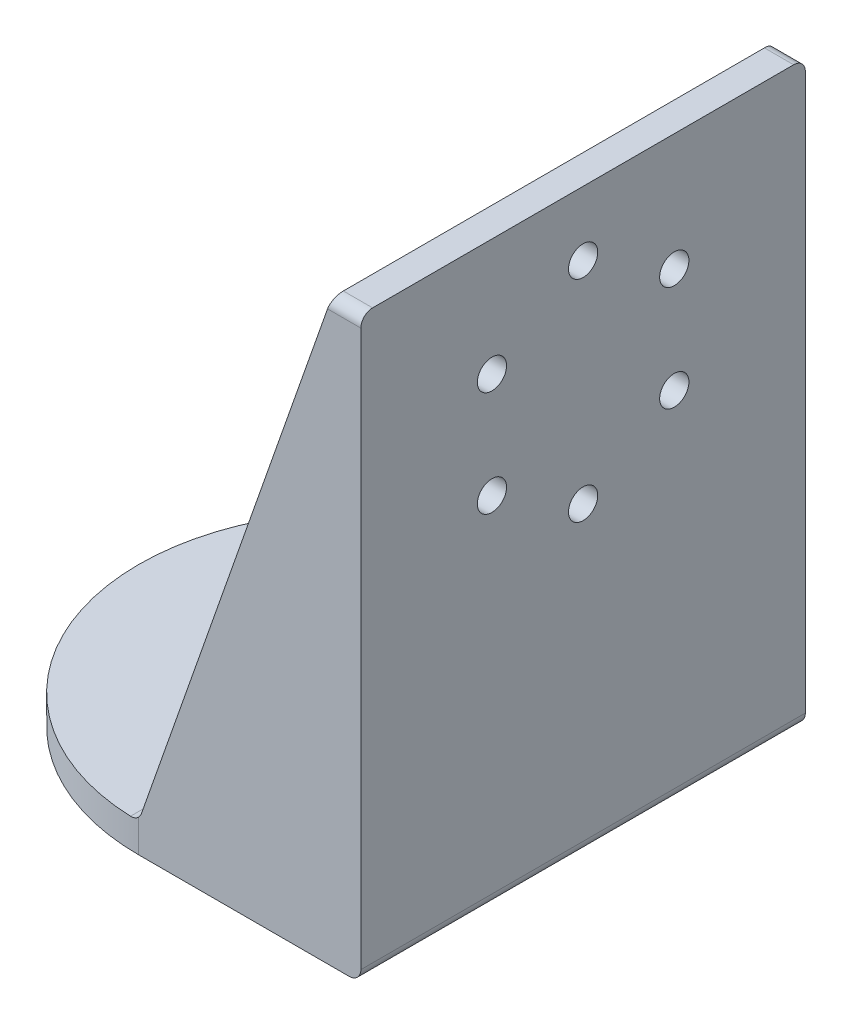
ISO-10303-21;
HEADER;
FILE_DESCRIPTION(('STEP AP214'),'2;1');
FILE_NAME('part.step','',(''),(''),'','','');
FILE_SCHEMA(('AUTOMOTIVE_DESIGN { 1 0 10303 214 1 1 1 1 }'));
ENDSEC;
DATA;
#1=APPLICATION_CONTEXT('core data for automotive mechanical design processes');
#2=APPLICATION_PROTOCOL_DEFINITION('international standard','automotive_design',2000,#1);
#3=PRODUCT_CONTEXT('',#1,'mechanical');
#4=PRODUCT('Part','Part','',(#3));
#5=PRODUCT_RELATED_PRODUCT_CATEGORY('part','',(#4));
#6=PRODUCT_DEFINITION_FORMATION('','',#4);
#7=PRODUCT_DEFINITION_CONTEXT('part definition',#1,'design');
#8=PRODUCT_DEFINITION('design','',#6,#7);
#9=PRODUCT_DEFINITION_SHAPE('','',#8);
#10=(LENGTH_UNIT() NAMED_UNIT(*) SI_UNIT(.MILLI.,.METRE.));
#11=(NAMED_UNIT(*) PLANE_ANGLE_UNIT() SI_UNIT($,.RADIAN.));
#12=(NAMED_UNIT(*) SI_UNIT($,.STERADIAN.) SOLID_ANGLE_UNIT());
#13=UNCERTAINTY_MEASURE_WITH_UNIT(LENGTH_MEASURE(1.E-05),#10,'distance_accuracy_value','');
#14=(GEOMETRIC_REPRESENTATION_CONTEXT(3) GLOBAL_UNCERTAINTY_ASSIGNED_CONTEXT((#13)) GLOBAL_UNIT_ASSIGNED_CONTEXT((#10,
#11,#12)) REPRESENTATION_CONTEXT('',''));
#15=CARTESIAN_POINT('',(0.,0.,0.));
#16=DIRECTION('',(0.,0.,1.));
#17=DIRECTION('',(1.,0.,0.));
#18=AXIS2_PLACEMENT_3D('',#15,#16,#17);
#19=CARTESIAN_POINT('',(71.,5.00000000000001,76.));
#20=DIRECTION('',(1.,0.,0.));
#21=DIRECTION('',(0.,0.,-1.));
#22=AXIS2_PLACEMENT_3D('',#19,#20,#21);
#23=PLANE('',#22);
#24=CARTESIAN_POINT('',(71.,61.,53.5884572681199));
#25=DIRECTION('',(1.,0.,0.));
#26=DIRECTION('',(0.,0.,-1.));
#27=AXIS2_PLACEMENT_3D('',#24,#25,#26);
#28=CIRCLE('',#27,2.5);
#29=CARTESIAN_POINT('',(71.,61.,51.0884572681199));
#30=VERTEX_POINT('',#29);
#31=EDGE_CURVE('E488',#30,#30,#28,.T.);
#32=ORIENTED_EDGE('',*,*,#31,.T.);
#33=EDGE_LOOP('',(#32));
#34=FACE_BOUND('',#33,.T.);
#35=CARTESIAN_POINT('',(71.,52.,38.));
#36=DIRECTION('',(1.,0.,0.));
#37=DIRECTION('',(0.,0.,-1.));
#38=AXIS2_PLACEMENT_3D('',#35,#36,#37);
#39=CIRCLE('',#38,2.5);
#40=CARTESIAN_POINT('',(71.,52.,35.5));
#41=VERTEX_POINT('',#40);
#42=EDGE_CURVE('E485',#41,#41,#39,.T.);
#43=ORIENTED_EDGE('',*,*,#42,.T.);
#44=EDGE_LOOP('',(#43));
#45=FACE_BOUND('',#44,.T.);
#46=CARTESIAN_POINT('',(71.,61.,22.4115427318801));
#47=DIRECTION('',(1.,0.,0.));
#48=DIRECTION('',(0.,0.,-1.));
#49=AXIS2_PLACEMENT_3D('',#46,#47,#48);
#50=CIRCLE('',#49,2.5);
#51=CARTESIAN_POINT('',(71.,61.,19.9115427318801));
#52=VERTEX_POINT('',#51);
#53=EDGE_CURVE('E477',#52,#52,#50,.T.);
#54=ORIENTED_EDGE('',*,*,#53,.T.);
#55=EDGE_LOOP('',(#54));
#56=FACE_BOUND('',#55,.T.);
#57=CARTESIAN_POINT('',(71.,79.,22.4115427318801));
#58=DIRECTION('',(1.,0.,0.));
#59=DIRECTION('',(0.,0.,-1.));
#60=AXIS2_PLACEMENT_3D('',#57,#58,#59);
#61=CIRCLE('',#60,2.5);
#62=CARTESIAN_POINT('',(71.,79.,19.9115427318801));
#63=VERTEX_POINT('',#62);
#64=EDGE_CURVE('E473',#63,#63,#61,.T.);
#65=ORIENTED_EDGE('',*,*,#64,.T.);
#66=EDGE_LOOP('',(#65));
#67=FACE_BOUND('',#66,.T.);
#68=CARTESIAN_POINT('',(71.,88.,38.));
#69=DIRECTION('',(1.,0.,0.));
#70=DIRECTION('',(0.,0.,-1.));
#71=AXIS2_PLACEMENT_3D('',#68,#69,#70);
#72=CIRCLE('',#71,2.5);
#73=CARTESIAN_POINT('',(71.,88.,35.5));
#74=VERTEX_POINT('',#73);
#75=EDGE_CURVE('E471',#74,#74,#72,.T.);
#76=ORIENTED_EDGE('',*,*,#75,.T.);
#77=EDGE_LOOP('',(#76));
#78=FACE_BOUND('',#77,.T.);
#79=CARTESIAN_POINT('',(71.,79.,53.5884572681199));
#80=DIRECTION('',(1.,0.,0.));
#81=DIRECTION('',(0.,0.,-1.));
#82=AXIS2_PLACEMENT_3D('',#79,#80,#81);
#83=CIRCLE('',#82,2.5);
#84=CARTESIAN_POINT('',(71.,79.,51.0884572681199));
#85=VERTEX_POINT('',#84);
#86=EDGE_CURVE('E474',#85,#85,#83,.T.);
#87=ORIENTED_EDGE('',*,*,#86,.T.);
#88=EDGE_LOOP('',(#87));
#89=FACE_BOUND('',#88,.T.);
#90=DIRECTION('',(0.,1.,0.));
#91=VECTOR('',#90,1.);
#92=CARTESIAN_POINT('',(71.,5.00000000000001,5.));
#93=LINE('',#92,#91);
#94=CARTESIAN_POINT('',(71.,15.,5.));
#95=VERTEX_POINT('',#94);
#96=CARTESIAN_POINT('',(71.,99.,5.));
#97=VERTEX_POINT('',#96);
#98=EDGE_CURVE('E173',#95,#97,#93,.T.);
#99=ORIENTED_EDGE('',*,*,#98,.F.);
#100=DIRECTION('',(0.,0.,1.));
#101=VECTOR('',#100,1.);
#102=CARTESIAN_POINT('',(71.,15.,71.));
#103=LINE('',#102,#101);
#104=CARTESIAN_POINT('',(71.,15.,71.));
#105=VERTEX_POINT('',#104);
#106=EDGE_CURVE('E180',#95,#105,#103,.T.);
#107=ORIENTED_EDGE('',*,*,#106,.T.);
#108=DIRECTION('',(0.,-1.,0.));
#109=VECTOR('',#108,1.);
#110=CARTESIAN_POINT('',(71.,5.00000000000001,71.));
#111=LINE('',#110,#109);
#112=CARTESIAN_POINT('',(71.,99.,71.));
#113=VERTEX_POINT('',#112);
#114=EDGE_CURVE('E168',#113,#105,#111,.T.);
#115=ORIENTED_EDGE('',*,*,#114,.F.);
#116=DIRECTION('',(0.,0.,-1.));
#117=VECTOR('',#116,1.);
#118=CARTESIAN_POINT('',(71.,99.,76.));
#119=LINE('',#118,#117);
#120=EDGE_CURVE('E162',#113,#97,#119,.T.);
#121=ORIENTED_EDGE('',*,*,#120,.T.);
#122=EDGE_LOOP('',(#99,#107,#115,#121));
#123=FACE_BOUND('',#122,.T.);
#124=ADVANCED_FACE('F38',(#34,#45,#56,#67,#78,#89,#123),#23,.F.);
#125=CARTESIAN_POINT('',(76.,0.,76.));
#126=DIRECTION('',(0.,1.,0.));
#127=DIRECTION('',(-1.,0.,0.));
#128=AXIS2_PLACEMENT_3D('',#125,#126,#127);
#129=PLANE('',#128);
#130=CARTESIAN_POINT('',(20.,0.,38.));
#131=DIRECTION('',(0.,1.,0.));
#132=DIRECTION('',(-1.,0.,0.));
#133=AXIS2_PLACEMENT_3D('',#130,#131,#132);
#134=CIRCLE('',#133,2.5);
#135=CARTESIAN_POINT('',(17.5,0.,38.));
#136=VERTEX_POINT('',#135);
#137=EDGE_CURVE('E379',#136,#136,#134,.T.);
#138=ORIENTED_EDGE('',*,*,#137,.T.);
#139=EDGE_LOOP('',(#138));
#140=FACE_BOUND('',#139,.T.);
#141=CARTESIAN_POINT('',(28.9999999999998,0.,53.5884572681198));
#142=DIRECTION('',(0.,1.,0.));
#143=DIRECTION('',(-1.,0.,0.));
#144=AXIS2_PLACEMENT_3D('',#141,#142,#143);
#145=CIRCLE('',#144,2.5);
#146=CARTESIAN_POINT('',(26.4999999999998,0.,53.5884572681198));
#147=VERTEX_POINT('',#146);
#148=EDGE_CURVE('E383',#147,#147,#145,.T.);
#149=ORIENTED_EDGE('',*,*,#148,.T.);
#150=EDGE_LOOP('',(#149));
#151=FACE_BOUND('',#150,.T.);
#152=CARTESIAN_POINT('',(46.9999999999999,0.,53.58845726812));
#153=DIRECTION('',(0.,1.,0.));
#154=DIRECTION('',(-1.,0.,0.));
#155=AXIS2_PLACEMENT_3D('',#152,#153,#154);
#156=CIRCLE('',#155,2.5);
#157=CARTESIAN_POINT('',(44.4999999999999,0.,53.58845726812));
#158=VERTEX_POINT('',#157);
#159=EDGE_CURVE('E517',#158,#158,#156,.T.);
#160=ORIENTED_EDGE('',*,*,#159,.T.);
#161=EDGE_LOOP('',(#160));
#162=FACE_BOUND('',#161,.T.);
#163=CARTESIAN_POINT('',(56.,0.,38.0000000000001));
#164=DIRECTION('',(0.,1.,0.));
#165=DIRECTION('',(-1.,0.,0.));
#166=AXIS2_PLACEMENT_3D('',#163,#164,#165);
#167=CIRCLE('',#166,2.5);
#168=CARTESIAN_POINT('',(53.5,0.,38.0000000000001));
#169=VERTEX_POINT('',#168);
#170=EDGE_CURVE('E514',#169,#169,#167,.T.);
#171=ORIENTED_EDGE('',*,*,#170,.T.);
#172=EDGE_LOOP('',(#171));
#173=FACE_BOUND('',#172,.T.);
#174=CARTESIAN_POINT('',(47.0000000000001,0.,22.4115427318801));
#175=DIRECTION('',(0.,1.,0.));
#176=DIRECTION('',(-1.,0.,0.));
#177=AXIS2_PLACEMENT_3D('',#174,#175,#176);
#178=CIRCLE('',#177,2.5);
#179=CARTESIAN_POINT('',(44.5000000000001,0.,22.4115427318801));
#180=VERTEX_POINT('',#179);
#181=EDGE_CURVE('E511',#180,#180,#178,.T.);
#182=ORIENTED_EDGE('',*,*,#181,.T.);
#183=EDGE_LOOP('',(#182));
#184=FACE_BOUND('',#183,.T.);
#185=CARTESIAN_POINT('',(29.,0.,22.4115427318801));
#186=DIRECTION('',(0.,1.,0.));
#187=DIRECTION('',(-1.,0.,0.));
#188=AXIS2_PLACEMENT_3D('',#185,#186,#187);
#189=CIRCLE('',#188,2.5);
#190=CARTESIAN_POINT('',(26.5,0.,22.4115427318801));
#191=VERTEX_POINT('',#190);
#192=EDGE_CURVE('E494',#191,#191,#189,.T.);
#193=ORIENTED_EDGE('',*,*,#192,.T.);
#194=EDGE_LOOP('',(#193));
#195=FACE_BOUND('',#194,.T.);
#196=DIRECTION('',(1.,0.,0.));
#197=VECTOR('',#196,1.);
#198=CARTESIAN_POINT('',(76.,0.,0.));
#199=LINE('',#198,#197);
#200=CARTESIAN_POINT('',(38.,0.,0.));
#201=VERTEX_POINT('',#200);
#202=CARTESIAN_POINT('',(74.,0.,0.));
#203=VERTEX_POINT('',#202);
#204=EDGE_CURVE('E213',#201,#203,#199,.T.);
#205=ORIENTED_EDGE('',*,*,#204,.T.);
#206=DIRECTION('',(0.,0.,-1.));
#207=VECTOR('',#206,1.);
#208=CARTESIAN_POINT('',(74.,0.,76.));
#209=LINE('',#208,#207);
#210=CARTESIAN_POINT('',(74.,0.,76.));
#211=VERTEX_POINT('',#210);
#212=EDGE_CURVE('E223',#203,#211,#209,.F.);
#213=ORIENTED_EDGE('',*,*,#212,.T.);
#214=DIRECTION('',(1.,0.,0.));
#215=VECTOR('',#214,1.);
#216=CARTESIAN_POINT('',(76.,0.,76.));
#217=LINE('',#216,#215);
#218=CARTESIAN_POINT('',(38.,0.,76.));
#219=VERTEX_POINT('',#218);
#220=EDGE_CURVE('E190',#219,#211,#217,.T.);
#221=ORIENTED_EDGE('',*,*,#220,.F.);
#222=CARTESIAN_POINT('',(38.,0.,38.));
#223=DIRECTION('',(0.,1.,0.));
#224=DIRECTION('',(-1.,0.,0.));
#225=AXIS2_PLACEMENT_3D('',#222,#223,#224);
#226=CIRCLE('',#225,38.);
#227=CARTESIAN_POINT('',(0.,0.,38.));
#228=VERTEX_POINT('',#227);
#229=EDGE_CURVE('E197',#219,#228,#226,.F.);
#230=ORIENTED_EDGE('',*,*,#229,.T.);
#231=CARTESIAN_POINT('',(38.,0.,38.));
#232=DIRECTION('',(0.,1.,0.));
#233=DIRECTION('',(-1.,0.,0.));
#234=AXIS2_PLACEMENT_3D('',#231,#232,#233);
#235=CIRCLE('',#234,38.);
#236=EDGE_CURVE('E199',#228,#201,#235,.F.);
#237=ORIENTED_EDGE('',*,*,#236,.T.);
#238=EDGE_LOOP('',(#205,#213,#221,#230,#237));
#239=FACE_BOUND('',#238,.T.);
#240=ADVANCED_FACE('F293',(#140,#151,#162,#173,#184,#195,#239),#129,.F.);
#241=CARTESIAN_POINT('',(76.,0.,76.));
#242=DIRECTION('',(-1.,0.,0.));
#243=DIRECTION('',(0.,0.,1.));
#244=AXIS2_PLACEMENT_3D('',#241,#242,#243);
#245=PLANE('',#244);
#246=CARTESIAN_POINT('',(76.,61.,53.5884572681199));
#247=DIRECTION('',(1.,0.,0.));
#248=DIRECTION('',(0.,0.,-1.));
#249=AXIS2_PLACEMENT_3D('',#246,#247,#248);
#250=CIRCLE('',#249,2.5);
#251=CARTESIAN_POINT('',(76.,61.,51.0884572681199));
#252=VERTEX_POINT('',#251);
#253=EDGE_CURVE('E316',#252,#252,#250,.T.);
#254=ORIENTED_EDGE('',*,*,#253,.F.);
#255=EDGE_LOOP('',(#254));
#256=FACE_BOUND('',#255,.T.);
#257=CARTESIAN_POINT('',(76.,52.,38.));
#258=DIRECTION('',(1.,0.,0.));
#259=DIRECTION('',(0.,0.,-1.));
#260=AXIS2_PLACEMENT_3D('',#257,#258,#259);
#261=CIRCLE('',#260,2.5);
#262=CARTESIAN_POINT('',(76.,52.,35.5));
#263=VERTEX_POINT('',#262);
#264=EDGE_CURVE('E320',#263,#263,#261,.T.);
#265=ORIENTED_EDGE('',*,*,#264,.F.);
#266=EDGE_LOOP('',(#265));
#267=FACE_BOUND('',#266,.T.);
#268=CARTESIAN_POINT('',(76.,61.,22.4115427318801));
#269=DIRECTION('',(1.,0.,0.));
#270=DIRECTION('',(0.,0.,-1.));
#271=AXIS2_PLACEMENT_3D('',#268,#269,#270);
#272=CIRCLE('',#271,2.5);
#273=CARTESIAN_POINT('',(76.,61.,19.9115427318801));
#274=VERTEX_POINT('',#273);
#275=EDGE_CURVE('E324',#274,#274,#272,.T.);
#276=ORIENTED_EDGE('',*,*,#275,.F.);
#277=EDGE_LOOP('',(#276));
#278=FACE_BOUND('',#277,.T.);
#279=CARTESIAN_POINT('',(76.,79.,22.4115427318801));
#280=DIRECTION('',(1.,0.,0.));
#281=DIRECTION('',(0.,0.,-1.));
#282=AXIS2_PLACEMENT_3D('',#279,#280,#281);
#283=CIRCLE('',#282,2.5);
#284=CARTESIAN_POINT('',(76.,79.,19.9115427318801));
#285=VERTEX_POINT('',#284);
#286=EDGE_CURVE('E328',#285,#285,#283,.T.);
#287=ORIENTED_EDGE('',*,*,#286,.F.);
#288=EDGE_LOOP('',(#287));
#289=FACE_BOUND('',#288,.T.);
#290=CARTESIAN_POINT('',(76.,88.,38.));
#291=DIRECTION('',(1.,0.,0.));
#292=DIRECTION('',(0.,0.,-1.));
#293=AXIS2_PLACEMENT_3D('',#290,#291,#292);
#294=CIRCLE('',#293,2.5);
#295=CARTESIAN_POINT('',(76.,88.,35.5));
#296=VERTEX_POINT('',#295);
#297=EDGE_CURVE('E332',#296,#296,#294,.T.);
#298=ORIENTED_EDGE('',*,*,#297,.F.);
#299=EDGE_LOOP('',(#298));
#300=FACE_BOUND('',#299,.T.);
#301=CARTESIAN_POINT('',(76.,79.,53.5884572681199));
#302=DIRECTION('',(1.,0.,0.));
#303=DIRECTION('',(0.,0.,-1.));
#304=AXIS2_PLACEMENT_3D('',#301,#302,#303);
#305=CIRCLE('',#304,2.5);
#306=CARTESIAN_POINT('',(76.,79.,51.0884572681199));
#307=VERTEX_POINT('',#306);
#308=EDGE_CURVE('E335',#307,#307,#305,.T.);
#309=ORIENTED_EDGE('',*,*,#308,.F.);
#310=EDGE_LOOP('',(#309));
#311=FACE_BOUND('',#310,.T.);
#312=DIRECTION('',(0.,1.,0.));
#313=VECTOR('',#312,1.);
#314=CARTESIAN_POINT('',(76.,0.,0.));
#315=LINE('',#314,#313);
#316=CARTESIAN_POINT('',(76.,2.,0.));
#317=VERTEX_POINT('',#316);
#318=CARTESIAN_POINT('',(76.,97.,0.));
#319=VERTEX_POINT('',#318);
#320=EDGE_CURVE('E194',#317,#319,#315,.T.);
#321=ORIENTED_EDGE('',*,*,#320,.T.);
#322=CARTESIAN_POINT('',(76.,97.,2.));
#323=DIRECTION('',(-1.,0.,0.));
#324=DIRECTION('',(0.,0.,1.));
#325=AXIS2_PLACEMENT_3D('',#322,#323,#324);
#326=CIRCLE('',#325,2.);
#327=CARTESIAN_POINT('',(76.,99.,2.));
#328=VERTEX_POINT('',#327);
#329=EDGE_CURVE('E339',#319,#328,#326,.F.);
#330=ORIENTED_EDGE('',*,*,#329,.T.);
#331=DIRECTION('',(0.,0.,-1.));
#332=VECTOR('',#331,1.);
#333=CARTESIAN_POINT('',(76.,99.,76.));
#334=LINE('',#333,#332);
#335=CARTESIAN_POINT('',(76.,99.,74.));
#336=VERTEX_POINT('',#335);
#337=EDGE_CURVE('E161',#336,#328,#334,.T.);
#338=ORIENTED_EDGE('',*,*,#337,.F.);
#339=CARTESIAN_POINT('',(76.,97.,74.));
#340=DIRECTION('',(-1.,0.,0.));
#341=DIRECTION('',(0.,0.,1.));
#342=AXIS2_PLACEMENT_3D('',#339,#340,#341);
#343=CIRCLE('',#342,2.);
#344=CARTESIAN_POINT('',(76.,97.,76.));
#345=VERTEX_POINT('',#344);
#346=EDGE_CURVE('E59',#336,#345,#343,.F.);
#347=ORIENTED_EDGE('',*,*,#346,.T.);
#348=DIRECTION('',(0.,1.,0.));
#349=VECTOR('',#348,1.);
#350=CARTESIAN_POINT('',(76.,0.,76.));
#351=LINE('',#350,#349);
#352=CARTESIAN_POINT('',(76.,2.,76.));
#353=VERTEX_POINT('',#352);
#354=EDGE_CURVE('E189',#353,#345,#351,.T.);
#355=ORIENTED_EDGE('',*,*,#354,.F.);
#356=DIRECTION('',(0.,0.,-1.));
#357=VECTOR('',#356,1.);
#358=CARTESIAN_POINT('',(76.,2.,76.));
#359=LINE('',#358,#357);
#360=EDGE_CURVE('E218',#353,#317,#359,.T.);
#361=ORIENTED_EDGE('',*,*,#360,.T.);
#362=EDGE_LOOP('',(#321,#330,#338,#347,#355,#361));
#363=FACE_BOUND('',#362,.T.);
#364=ADVANCED_FACE('F299',(#256,#267,#278,#289,#300,#311,#363),#245,.F.);
#365=CARTESIAN_POINT('',(76.,99.,76.));
#366=DIRECTION('',(0.,-1.,0.));
#367=DIRECTION('',(0.,0.,-1.));
#368=AXIS2_PLACEMENT_3D('',#365,#366,#367);
#369=PLANE('',#368);
#370=ORIENTED_EDGE('',*,*,#337,.T.);
#371=DIRECTION('',(-1.,0.,0.));
#372=VECTOR('',#371,1.);
#373=CARTESIAN_POINT('',(76.,99.,2.));
#374=LINE('',#373,#372);
#375=CARTESIAN_POINT('',(71.,99.,2.00000000000003));
#376=VERTEX_POINT('',#375);
#377=EDGE_CURVE('E347',#328,#376,#374,.T.);
#378=ORIENTED_EDGE('',*,*,#377,.T.);
#379=DIRECTION('',(0.,0.,1.));
#380=VECTOR('',#379,1.);
#381=CARTESIAN_POINT('',(71.,99.,76.));
#382=LINE('',#381,#380);
#383=EDGE_CURVE('E188',#97,#376,#382,.F.);
#384=ORIENTED_EDGE('',*,*,#383,.F.);
#385=ORIENTED_EDGE('',*,*,#120,.F.);
#386=CARTESIAN_POINT('',(71.,99.,74.));
#387=VERTEX_POINT('',#386);
#388=EDGE_CURVE('E152',#387,#113,#119,.T.);
#389=ORIENTED_EDGE('',*,*,#388,.F.);
#390=DIRECTION('',(-1.,0.,0.));
#391=VECTOR('',#390,1.);
#392=CARTESIAN_POINT('',(76.,99.,74.));
#393=LINE('',#392,#391);
#394=EDGE_CURVE('E355',#387,#336,#393,.F.);
#395=ORIENTED_EDGE('',*,*,#394,.T.);
#396=EDGE_LOOP('',(#370,#378,#384,#385,#389,#395));
#397=FACE_BOUND('',#396,.T.);
#398=ADVANCED_FACE('F185',(#397),#369,.F.);
#399=CARTESIAN_POINT('',(71.,5.00000000000001,76.));
#400=DIRECTION('',(0.,-1.,0.));
#401=DIRECTION('',(1.,0.,0.));
#402=AXIS2_PLACEMENT_3D('',#399,#400,#401);
#403=PLANE('',#402);
#404=CARTESIAN_POINT('',(20.,5.,38.));
#405=DIRECTION('',(0.,1.,0.));
#406=DIRECTION('',(-1.,0.,0.));
#407=AXIS2_PLACEMENT_3D('',#404,#405,#406);
#408=CIRCLE('',#407,2.5);
#409=CARTESIAN_POINT('',(17.5,5.,38.));
#410=VERTEX_POINT('',#409);
#411=EDGE_CURVE('E491',#410,#410,#408,.T.);
#412=ORIENTED_EDGE('',*,*,#411,.F.);
#413=EDGE_LOOP('',(#412));
#414=FACE_BOUND('',#413,.T.);
#415=CARTESIAN_POINT('',(28.9999999999998,5.,53.5884572681198));
#416=DIRECTION('',(0.,1.,0.));
#417=DIRECTION('',(-1.,0.,0.));
#418=AXIS2_PLACEMENT_3D('',#415,#416,#417);
#419=CIRCLE('',#418,2.5);
#420=CARTESIAN_POINT('',(26.4999999999998,5.,53.5884572681198));
#421=VERTEX_POINT('',#420);
#422=EDGE_CURVE('E490',#421,#421,#419,.T.);
#423=ORIENTED_EDGE('',*,*,#422,.F.);
#424=EDGE_LOOP('',(#423));
#425=FACE_BOUND('',#424,.T.);
#426=CARTESIAN_POINT('',(46.9999999999999,5.00000000000001,53.58845726812));
#427=DIRECTION('',(0.,1.,0.));
#428=DIRECTION('',(-1.,0.,0.));
#429=AXIS2_PLACEMENT_3D('',#426,#427,#428);
#430=CIRCLE('',#429,2.5);
#431=CARTESIAN_POINT('',(44.4999999999999,5.00000000000001,53.58845726812));
#432=VERTEX_POINT('',#431);
#433=EDGE_CURVE('E498',#432,#432,#430,.T.);
#434=ORIENTED_EDGE('',*,*,#433,.F.);
#435=EDGE_LOOP('',(#434));
#436=FACE_BOUND('',#435,.T.);
#437=CARTESIAN_POINT('',(56.,5.00000000000001,38.0000000000001));
#438=DIRECTION('',(0.,1.,0.));
#439=DIRECTION('',(-1.,0.,0.));
#440=AXIS2_PLACEMENT_3D('',#437,#438,#439);
#441=CIRCLE('',#440,2.5);
#442=CARTESIAN_POINT('',(53.5,5.00000000000001,38.0000000000001));
#443=VERTEX_POINT('',#442);
#444=EDGE_CURVE('E504',#443,#443,#441,.T.);
#445=ORIENTED_EDGE('',*,*,#444,.F.);
#446=EDGE_LOOP('',(#445));
#447=FACE_BOUND('',#446,.T.);
#448=CARTESIAN_POINT('',(47.0000000000001,5.00000000000001,22.4115427318801));
#449=DIRECTION('',(0.,1.,0.));
#450=DIRECTION('',(-1.,0.,0.));
#451=AXIS2_PLACEMENT_3D('',#448,#449,#450);
#452=CIRCLE('',#451,2.5);
#453=CARTESIAN_POINT('',(44.5000000000001,5.00000000000001,22.4115427318801));
#454=VERTEX_POINT('',#453);
#455=EDGE_CURVE('E501',#454,#454,#452,.T.);
#456=ORIENTED_EDGE('',*,*,#455,.F.);
#457=EDGE_LOOP('',(#456));
#458=FACE_BOUND('',#457,.T.);
#459=CARTESIAN_POINT('',(29.,5.,22.4115427318801));
#460=DIRECTION('',(0.,1.,0.));
#461=DIRECTION('',(-1.,0.,0.));
#462=AXIS2_PLACEMENT_3D('',#459,#460,#461);
#463=CIRCLE('',#462,2.5);
#464=CARTESIAN_POINT('',(26.5,5.,22.4115427318801));
#465=VERTEX_POINT('',#464);
#466=EDGE_CURVE('E495',#465,#465,#463,.T.);
#467=ORIENTED_EDGE('',*,*,#466,.F.);
#468=EDGE_LOOP('',(#467));
#469=FACE_BOUND('',#468,.T.);
#470=CARTESIAN_POINT('',(38.,5.,38.));
#471=DIRECTION('',(0.,-1.,0.));
#472=DIRECTION('',(1.,0.,0.));
#473=AXIS2_PLACEMENT_3D('',#470,#471,#472);
#474=CIRCLE('',#473,38.);
#475=CARTESIAN_POINT('',(0.,5.,38.));
#476=VERTEX_POINT('',#475);
#477=CARTESIAN_POINT('',(36.5824618249818,5.,75.973551131312));
#478=VERTEX_POINT('',#477);
#479=EDGE_CURVE('E203',#476,#478,#474,.F.);
#480=ORIENTED_EDGE('',*,*,#479,.T.);
#481=DIRECTION('',(0.,0.,-1.));
#482=VECTOR('',#481,1.);
#483=CARTESIAN_POINT('',(36.5824618249818,5.,76.));
#484=LINE('',#483,#482);
#485=CARTESIAN_POINT('',(36.5824618249818,5.,71.));
#486=VERTEX_POINT('',#485);
#487=EDGE_CURVE('E238',#478,#486,#484,.T.);
#488=ORIENTED_EDGE('',*,*,#487,.T.);
#489=DIRECTION('',(-1.,0.,0.));
#490=VECTOR('',#489,1.);
#491=CARTESIAN_POINT('',(71.,5.00000000000001,71.));
#492=LINE('',#491,#490);
#493=CARTESIAN_POINT('',(66.,5.00000000000001,71.));
#494=VERTEX_POINT('',#493);
#495=EDGE_CURVE('E210',#494,#486,#492,.T.);
#496=ORIENTED_EDGE('',*,*,#495,.F.);
#497=DIRECTION('',(0.,0.,-1.));
#498=VECTOR('',#497,1.);
#499=CARTESIAN_POINT('',(66.,5.00000000000001,5.));
#500=LINE('',#499,#498);
#501=CARTESIAN_POINT('',(66.,5.00000000000001,5.));
#502=VERTEX_POINT('',#501);
#503=EDGE_CURVE('E227',#494,#502,#500,.T.);
#504=ORIENTED_EDGE('',*,*,#503,.T.);
#505=DIRECTION('',(1.,0.,0.));
#506=VECTOR('',#505,1.);
#507=CARTESIAN_POINT('',(71.,5.00000000000001,5.));
#508=LINE('',#507,#506);
#509=CARTESIAN_POINT('',(36.5824618249818,5.,5.));
#510=VERTEX_POINT('',#509);
#511=EDGE_CURVE('E215',#510,#502,#508,.T.);
#512=ORIENTED_EDGE('',*,*,#511,.F.);
#513=DIRECTION('',(0.,0.,1.));
#514=VECTOR('',#513,1.);
#515=CARTESIAN_POINT('',(36.5824618249818,5.,76.));
#516=LINE('',#515,#514);
#517=CARTESIAN_POINT('',(36.5824618249818,5.,0.0264488686880088));
#518=VERTEX_POINT('',#517);
#519=EDGE_CURVE('E235',#510,#518,#516,.F.);
#520=ORIENTED_EDGE('',*,*,#519,.T.);
#521=CARTESIAN_POINT('',(38.,5.,38.));
#522=DIRECTION('',(0.,-1.,0.));
#523=DIRECTION('',(1.,0.,0.));
#524=AXIS2_PLACEMENT_3D('',#521,#522,#523);
#525=CIRCLE('',#524,38.);
#526=EDGE_CURVE('E206',#518,#476,#525,.F.);
#527=ORIENTED_EDGE('',*,*,#526,.T.);
#528=EDGE_LOOP('',(#480,#488,#496,#504,#512,#520,#527));
#529=FACE_BOUND('',#528,.T.);
#530=ADVANCED_FACE('F305',(#414,#425,#436,#447,#458,#469,#529),#403,.F.);
#531=CARTESIAN_POINT('',(0.,0.,76.));
#532=DIRECTION('',(0.,0.,1.));
#533=DIRECTION('',(1.,0.,0.));
#534=AXIS2_PLACEMENT_3D('',#531,#532,#533);
#535=PLANE('',#534);
#536=ORIENTED_EDGE('',*,*,#354,.T.);
#537=DIRECTION('',(-1.,0.,0.));
#538=VECTOR('',#537,1.);
#539=CARTESIAN_POINT('',(71.,97.,76.));
#540=LINE('',#539,#538);
#541=CARTESIAN_POINT('',(70.2978723404255,97.,76.));
#542=VERTEX_POINT('',#541);
#543=EDGE_CURVE('E46',#345,#542,#540,.T.);
#544=ORIENTED_EDGE('',*,*,#543,.T.);
#545=DIRECTION('',(-0.331244504730807,-0.943544952869572,0.));
#546=VECTOR('',#545,1.);
#547=CARTESIAN_POINT('',(71.,99.,76.));
#548=LINE('',#547,#546);
#549=CARTESIAN_POINT('',(38.4695517307209,6.33751099053839,76.));
#550=VERTEX_POINT('',#549);
#551=EDGE_CURVE('E172',#542,#550,#548,.T.);
#552=ORIENTED_EDGE('',*,*,#551,.T.);
#553=CARTESIAN_POINT('',(36.5824618249818,7.,76.));
#554=DIRECTION('',(0.,0.,1.));
#555=DIRECTION('',(1.,0.,0.));
#556=AXIS2_PLACEMENT_3D('',#553,#554,#555);
#557=CIRCLE('',#556,2.);
#558=CARTESIAN_POINT('',(38.,5.58911888439614,76.));
#559=VERTEX_POINT('',#558);
#560=EDGE_CURVE('E246',#550,#559,#557,.F.);
#561=ORIENTED_EDGE('',*,*,#560,.T.);
#562=DIRECTION('',(0.,-1.,0.));
#563=VECTOR('',#562,1.);
#564=CARTESIAN_POINT('',(38.,0.,76.));
#565=LINE('',#564,#563);
#566=EDGE_CURVE('E208',#559,#219,#565,.T.);
#567=ORIENTED_EDGE('',*,*,#566,.T.);
#568=ORIENTED_EDGE('',*,*,#220,.T.);
#569=CARTESIAN_POINT('',(74.,2.,76.));
#570=DIRECTION('',(0.,0.,1.));
#571=DIRECTION('',(1.,0.,0.));
#572=AXIS2_PLACEMENT_3D('',#569,#570,#571);
#573=CIRCLE('',#572,2.);
#574=EDGE_CURVE('E225',#211,#353,#573,.T.);
#575=ORIENTED_EDGE('',*,*,#574,.T.);
#576=EDGE_LOOP('',(#536,#544,#552,#561,#567,#568,#575));
#577=FACE_BOUND('',#576,.T.);
#578=ADVANCED_FACE('F397',(#577),#535,.T.);
#579=CARTESIAN_POINT('',(0.,0.,0.));
#580=DIRECTION('',(0.,0.,1.));
#581=DIRECTION('',(1.,0.,0.));
#582=AXIS2_PLACEMENT_3D('',#579,#580,#581);
#583=PLANE('',#582);
#584=DIRECTION('',(-0.331244504730807,-0.943544952869572,0.));
#585=VECTOR('',#584,1.);
#586=CARTESIAN_POINT('',(71.,99.,0.));
#587=LINE('',#586,#585);
#588=CARTESIAN_POINT('',(70.2978723404255,97.,0.));
#589=VERTEX_POINT('',#588);
#590=CARTESIAN_POINT('',(38.4695517307209,6.33751099053839,0.));
#591=VERTEX_POINT('',#590);
#592=EDGE_CURVE('E376',#589,#591,#587,.T.);
#593=ORIENTED_EDGE('',*,*,#592,.F.);
#594=DIRECTION('',(-1.,0.,0.));
#595=VECTOR('',#594,1.);
#596=CARTESIAN_POINT('',(0.,97.,0.));
#597=LINE('',#596,#595);
#598=EDGE_CURVE('E346',#589,#319,#597,.F.);
#599=ORIENTED_EDGE('',*,*,#598,.T.);
#600=ORIENTED_EDGE('',*,*,#320,.F.);
#601=CARTESIAN_POINT('',(74.,2.,0.));
#602=DIRECTION('',(0.,0.,1.));
#603=DIRECTION('',(1.,0.,0.));
#604=AXIS2_PLACEMENT_3D('',#601,#602,#603);
#605=CIRCLE('',#604,2.);
#606=EDGE_CURVE('E221',#317,#203,#605,.F.);
#607=ORIENTED_EDGE('',*,*,#606,.T.);
#608=ORIENTED_EDGE('',*,*,#204,.F.);
#609=DIRECTION('',(0.,-1.,0.));
#610=VECTOR('',#609,1.);
#611=CARTESIAN_POINT('',(38.,0.,0.));
#612=LINE('',#611,#610);
#613=CARTESIAN_POINT('',(38.,5.58911888439614,0.));
#614=VERTEX_POINT('',#613);
#615=EDGE_CURVE('E201',#201,#614,#612,.F.);
#616=ORIENTED_EDGE('',*,*,#615,.T.);
#617=CARTESIAN_POINT('',(36.5824618249818,7.,0.));
#618=DIRECTION('',(0.,0.,1.));
#619=DIRECTION('',(1.,0.,0.));
#620=AXIS2_PLACEMENT_3D('',#617,#618,#619);
#621=CIRCLE('',#620,2.);
#622=EDGE_CURVE('E359',#614,#591,#621,.T.);
#623=ORIENTED_EDGE('',*,*,#622,.T.);
#624=EDGE_LOOP('',(#593,#599,#600,#607,#608,#616,#623));
#625=FACE_BOUND('',#624,.T.);
#626=ADVANCED_FACE('F273',(#625),#583,.F.);
#627=CARTESIAN_POINT('',(38.,0.,38.));
#628=DIRECTION('',(0.,1.,0.));
#629=DIRECTION('',(0.,0.,1.));
#630=AXIS2_PLACEMENT_3D('',#627,#628,#629);
#631=CYLINDRICAL_SURFACE('',#630,38.);
#632=DIRECTION('',(0.,-1.,0.));
#633=VECTOR('',#632,1.);
#634=CARTESIAN_POINT('',(0.,5.,38.));
#635=LINE('',#634,#633);
#636=EDGE_CURVE('E181',#228,#476,#635,.F.);
#637=ORIENTED_EDGE('',*,*,#636,.F.);
#638=ORIENTED_EDGE('',*,*,#229,.F.);
#639=ORIENTED_EDGE('',*,*,#566,.F.);
#640=CARTESIAN_POINT('',(38.,5.58911888439614,76.));
#641=CARTESIAN_POINT('',(37.9603652802177,5.54929826499001,75.9999999680676));
#642=CARTESIAN_POINT('',(37.9190719469166,5.51116731438771,75.9999378897337));
#643=CARTESIAN_POINT('',(37.8334267970988,5.43851218891439,75.9996591034837));
#644=CARTESIAN_POINT('',(37.7890750058964,5.40398798419688,75.9994423968473));
#645=CARTESIAN_POINT('',(37.6518408638772,5.3061812545092,75.9985146765362));
#646=CARTESIAN_POINT('',(37.5547605800685,5.24864539130941,75.9975260915734));
#647=CARTESIAN_POINT('',(37.3523323964933,5.15068160476845,75.9946153064681));
#648=CARTESIAN_POINT('',(37.2469787646648,5.11026566890233,75.992692454162));
#649=CARTESIAN_POINT('',(37.0311303836773,5.04775330402254,75.9877990694973));
#650=CARTESIAN_POINT('',(36.9206464007558,5.0256201933999,75.9848306520628));
#651=CARTESIAN_POINT('',(36.7715786408423,5.00859812153087,75.9801582531553));
#652=CARTESIAN_POINT('',(36.7337993987633,5.00537278106408,75.9789175158347));
#653=CARTESIAN_POINT('',(36.6581720655158,5.00107625468577,75.9763205337933));
#654=CARTESIAN_POINT('',(36.6203241287098,5.00000226084565,75.9749644420471));
#655=CARTESIAN_POINT('',(36.5824618249818,5.,75.973551131312));
#656=B_SPLINE_CURVE_WITH_KNOTS('',3,(#640,#641,#642,#643,#644,#645,#646,#647,#648,#649,#650,
#651,#652,#653,#654,#655),.UNSPECIFIED.,.F.,.F.,(4,2,2,2,2,2,2,4),(0.,0.168446005969353,
0.336890617906489,0.67369944274881,1.01074371485057,1.34711010687543,1.46087645929454,
1.57449422734378),.UNSPECIFIED.);
#657=EDGE_CURVE('E249',#559,#478,#656,.T.);
#658=ORIENTED_EDGE('',*,*,#657,.T.);
#659=ORIENTED_EDGE('',*,*,#479,.F.);
#660=EDGE_LOOP('',(#637,#638,#639,#658,#659));
#661=FACE_BOUND('',#660,.T.);
#662=ADVANCED_FACE('F268',(#661),#631,.T.);
#663=CARTESIAN_POINT('',(38.,0.,38.));
#664=DIRECTION('',(0.,-1.,0.));
#665=DIRECTION('',(0.,0.,-1.));
#666=AXIS2_PLACEMENT_3D('',#663,#664,#665);
#667=CYLINDRICAL_SURFACE('',#666,38.);
#668=ORIENTED_EDGE('',*,*,#526,.F.);
#669=CARTESIAN_POINT('',(36.5824618249818,5.,0.0264488686880088));
#670=CARTESIAN_POINT('',(36.6386060912109,5.00000076943304,0.0243523472667707));
#671=CARTESIAN_POINT('',(36.6947276364158,5.002365799377,0.0223828826837404));
#672=CARTESIAN_POINT('',(36.8065815167694,5.01180369831061,0.0187035913040849));
#673=CARTESIAN_POINT('',(36.862313854707,5.01887653352938,0.0169937626451009));
#674=CARTESIAN_POINT('',(37.0283856933773,5.04712119539932,0.0122627413648183));
#675=CARTESIAN_POINT('',(37.1376276621965,5.07531919929609,0.00963898833669632));
#676=CARTESIAN_POINT('',(37.3498514487392,5.14965138405486,0.00541328764114167));
#677=CARTESIAN_POINT('',(37.4528288261106,5.19579811958932,0.0038120572774896));
#678=CARTESIAN_POINT('',(37.6494528182011,5.3046813178509,0.00149008817707733));
#679=CARTESIAN_POINT('',(37.7431177738643,5.36738424474409,0.000767585910525769));
#680=CARTESIAN_POINT('',(37.8604038608786,5.46106784215736,0.000244718863868773));
#681=CARTESIAN_POINT('',(37.8893582777223,5.48558123201093,0.000150523482961961));
#682=CARTESIAN_POINT('',(37.945790228704,5.53618116330196,2.82660964252218E-05));
#683=CARTESIAN_POINT('',(37.9732696428899,5.56226560766266,1.17851897539106E-07));
#684=CARTESIAN_POINT('',(37.9999999999998,5.58911888439645,0.));
#685=B_SPLINE_CURVE_WITH_KNOTS('',3,(#669,#670,#671,#672,#673,#674,#675,#676,#677,#678,#679,
#680,#681,#682,#683,#684),.UNSPECIFIED.,.F.,.F.,(4,2,2,2,2,2,2,4),(0.,0.168445657824856,
0.336890107338107,0.673697072255767,1.01074004981906,1.3471054897296,1.46087419039381,
1.57449425841667),.UNSPECIFIED.);
#686=EDGE_CURVE('E257',#518,#614,#685,.T.);
#687=ORIENTED_EDGE('',*,*,#686,.T.);
#688=ORIENTED_EDGE('',*,*,#615,.F.);
#689=ORIENTED_EDGE('',*,*,#236,.F.);
#690=ORIENTED_EDGE('',*,*,#636,.T.);
#691=EDGE_LOOP('',(#668,#687,#688,#689,#690));
#692=FACE_BOUND('',#691,.T.);
#693=ADVANCED_FACE('F272',(#692),#667,.T.);
#694=CARTESIAN_POINT('',(38.,49.5,71.));
#695=DIRECTION('',(0.,0.,1.));
#696=DIRECTION('',(1.,0.,0.));
#697=AXIS2_PLACEMENT_3D('',#694,#695,#696);
#698=PLANE('',#697);
#699=ORIENTED_EDGE('',*,*,#114,.T.);
#700=DIRECTION('',(0.44721359549996,0.894427190999915,0.));
#701=VECTOR('',#700,1.);
#702=CARTESIAN_POINT('',(66.,5.00000000000001,71.));
#703=LINE('',#702,#701);
#704=EDGE_CURVE('E233',#105,#494,#703,.F.);
#705=ORIENTED_EDGE('',*,*,#704,.T.);
#706=ORIENTED_EDGE('',*,*,#495,.T.);
#707=CARTESIAN_POINT('',(36.5824618249818,7.,71.));
#708=DIRECTION('',(0.,0.,1.));
#709=DIRECTION('',(1.,0.,0.));
#710=AXIS2_PLACEMENT_3D('',#707,#708,#709);
#711=CIRCLE('',#710,2.);
#712=CARTESIAN_POINT('',(38.4695517307209,6.33751099053839,71.));
#713=VERTEX_POINT('',#712);
#714=EDGE_CURVE('E171',#486,#713,#711,.T.);
#715=ORIENTED_EDGE('',*,*,#714,.T.);
#716=DIRECTION('',(-0.331244504730807,-0.943544952869572,0.));
#717=VECTOR('',#716,1.);
#718=CARTESIAN_POINT('',(71.,99.,71.));
#719=LINE('',#718,#717);
#720=EDGE_CURVE('E157',#113,#713,#719,.T.);
#721=ORIENTED_EDGE('',*,*,#720,.F.);
#722=EDGE_LOOP('',(#699,#705,#706,#715,#721));
#723=FACE_BOUND('',#722,.T.);
#724=ADVANCED_FACE('F167',(#723),#698,.F.);
#725=CARTESIAN_POINT('',(71.,99.,76.));
#726=DIRECTION('',(-0.943544952869572,0.331244504730807,0.));
#727=DIRECTION('',(-0.331244504730807,-0.943544952869572,0.));
#728=AXIS2_PLACEMENT_3D('',#725,#726,#727);
#729=PLANE('',#728);
#730=ORIENTED_EDGE('',*,*,#551,.F.);
#731=CARTESIAN_POINT('',(70.2978723404255,97.,74.));
#732=DIRECTION('',(-0.943544952869572,0.331244504730807,0.));
#733=DIRECTION('',(0.331244504730807,0.943544952869572,0.));
#734=AXIS2_PLACEMENT_3D('',#731,#732,#733);
#735=ELLIPSE('',#734,2.11966583459269,2.);
#736=EDGE_CURVE('E11',#542,#387,#735,.T.);
#737=ORIENTED_EDGE('',*,*,#736,.T.);
#738=ORIENTED_EDGE('',*,*,#388,.T.);
#739=ORIENTED_EDGE('',*,*,#720,.T.);
#740=DIRECTION('',(0.,0.,-1.));
#741=VECTOR('',#740,1.);
#742=CARTESIAN_POINT('',(38.4695517307209,6.33751099053841,76.));
#743=LINE('',#742,#741);
#744=EDGE_CURVE('E241',#713,#550,#743,.F.);
#745=ORIENTED_EDGE('',*,*,#744,.T.);
#746=EDGE_LOOP('',(#730,#737,#738,#739,#745));
#747=FACE_BOUND('',#746,.T.);
#748=ADVANCED_FACE('F155',(#747),#729,.T.);
#749=CARTESIAN_POINT('',(38.,49.5,5.));
#750=DIRECTION('',(0.,0.,-1.));
#751=DIRECTION('',(-1.,0.,0.));
#752=AXIS2_PLACEMENT_3D('',#749,#750,#751);
#753=PLANE('',#752);
#754=ORIENTED_EDGE('',*,*,#511,.T.);
#755=DIRECTION('',(-0.44721359549996,-0.894427190999915,0.));
#756=VECTOR('',#755,1.);
#757=CARTESIAN_POINT('',(66.,5.00000000000001,5.));
#758=LINE('',#757,#756);
#759=EDGE_CURVE('E230',#502,#95,#758,.F.);
#760=ORIENTED_EDGE('',*,*,#759,.T.);
#761=ORIENTED_EDGE('',*,*,#98,.T.);
#762=DIRECTION('',(-0.331244504730807,-0.943544952869572,0.));
#763=VECTOR('',#762,1.);
#764=CARTESIAN_POINT('',(71.,99.,5.));
#765=LINE('',#764,#763);
#766=CARTESIAN_POINT('',(38.4695517307209,6.33751099053839,5.));
#767=VERTEX_POINT('',#766);
#768=EDGE_CURVE('E375',#97,#767,#765,.T.);
#769=ORIENTED_EDGE('',*,*,#768,.T.);
#770=CARTESIAN_POINT('',(36.5824618249818,7.,5.));
#771=DIRECTION('',(0.,0.,-1.));
#772=DIRECTION('',(-1.,0.,0.));
#773=AXIS2_PLACEMENT_3D('',#770,#771,#772);
#774=CIRCLE('',#773,2.);
#775=EDGE_CURVE('E357',#767,#510,#774,.T.);
#776=ORIENTED_EDGE('',*,*,#775,.T.);
#777=EDGE_LOOP('',(#754,#760,#761,#769,#776));
#778=FACE_BOUND('',#777,.T.);
#779=ADVANCED_FACE('F378',(#778),#753,.F.);
#780=CARTESIAN_POINT('',(71.,99.,0.));
#781=DIRECTION('',(0.943544952869572,-0.331244504730807,0.));
#782=DIRECTION('',(-0.331244504730807,-0.943544952869572,0.));
#783=AXIS2_PLACEMENT_3D('',#780,#781,#782);
#784=PLANE('',#783);
#785=ORIENTED_EDGE('',*,*,#383,.T.);
#786=CARTESIAN_POINT('',(70.2978723404255,97.,2.));
#787=DIRECTION('',(0.943544952869572,-0.331244504730807,0.));
#788=DIRECTION('',(-0.331244504730807,-0.943544952869572,0.));
#789=AXIS2_PLACEMENT_3D('',#786,#787,#788);
#790=ELLIPSE('',#789,2.11966583459269,2.);
#791=EDGE_CURVE('E352',#376,#589,#790,.F.);
#792=ORIENTED_EDGE('',*,*,#791,.T.);
#793=ORIENTED_EDGE('',*,*,#592,.T.);
#794=DIRECTION('',(0.,0.,-1.));
#795=VECTOR('',#794,1.);
#796=CARTESIAN_POINT('',(38.4695517307209,6.33751099053841,0.));
#797=LINE('',#796,#795);
#798=EDGE_CURVE('E243',#591,#767,#797,.F.);
#799=ORIENTED_EDGE('',*,*,#798,.T.);
#800=ORIENTED_EDGE('',*,*,#768,.F.);
#801=EDGE_LOOP('',(#785,#792,#793,#799,#800));
#802=FACE_BOUND('',#801,.T.);
#803=ADVANCED_FACE('F374',(#802),#784,.F.);
#804=CARTESIAN_POINT('',(29.,-5.,22.4115427318801));
#805=DIRECTION('',(0.,1.,0.));
#806=DIRECTION('',(-1.,0.,0.));
#807=AXIS2_PLACEMENT_3D('',#804,#805,#806);
#808=CYLINDRICAL_SURFACE('',#807,2.5);
#809=ORIENTED_EDGE('',*,*,#466,.T.);
#810=EDGE_LOOP('',(#809));
#811=FACE_BOUND('',#810,.T.);
#812=ORIENTED_EDGE('',*,*,#192,.F.);
#813=EDGE_LOOP('',(#812));
#814=FACE_BOUND('',#813,.T.);
#815=ADVANCED_FACE('F418',(#811,#814),#808,.F.);
#816=CARTESIAN_POINT('',(47.0000000000001,-4.99999999999999,22.4115427318801));
#817=DIRECTION('',(0.,1.,0.));
#818=DIRECTION('',(-1.,0.,0.));
#819=AXIS2_PLACEMENT_3D('',#816,#817,#818);
#820=CYLINDRICAL_SURFACE('',#819,2.5);
#821=ORIENTED_EDGE('',*,*,#455,.T.);
#822=EDGE_LOOP('',(#821));
#823=FACE_BOUND('',#822,.T.);
#824=ORIENTED_EDGE('',*,*,#181,.F.);
#825=EDGE_LOOP('',(#824));
#826=FACE_BOUND('',#825,.T.);
#827=ADVANCED_FACE('F429',(#823,#826),#820,.F.);
#828=CARTESIAN_POINT('',(56.,-4.99999999999999,38.0000000000001));
#829=DIRECTION('',(0.,1.,0.));
#830=DIRECTION('',(-1.,0.,0.));
#831=AXIS2_PLACEMENT_3D('',#828,#829,#830);
#832=CYLINDRICAL_SURFACE('',#831,2.5);
#833=ORIENTED_EDGE('',*,*,#444,.T.);
#834=EDGE_LOOP('',(#833));
#835=FACE_BOUND('',#834,.T.);
#836=ORIENTED_EDGE('',*,*,#170,.F.);
#837=EDGE_LOOP('',(#836));
#838=FACE_BOUND('',#837,.T.);
#839=ADVANCED_FACE('F425',(#835,#838),#832,.F.);
#840=CARTESIAN_POINT('',(46.9999999999999,-4.99999999999999,53.58845726812));
#841=DIRECTION('',(0.,1.,0.));
#842=DIRECTION('',(-1.,0.,0.));
#843=AXIS2_PLACEMENT_3D('',#840,#841,#842);
#844=CYLINDRICAL_SURFACE('',#843,2.5);
#845=ORIENTED_EDGE('',*,*,#433,.T.);
#846=EDGE_LOOP('',(#845));
#847=FACE_BOUND('',#846,.T.);
#848=ORIENTED_EDGE('',*,*,#159,.F.);
#849=EDGE_LOOP('',(#848));
#850=FACE_BOUND('',#849,.T.);
#851=ADVANCED_FACE('F421',(#847,#850),#844,.F.);
#852=CARTESIAN_POINT('',(28.9999999999998,-5.,53.5884572681198));
#853=DIRECTION('',(0.,1.,0.));
#854=DIRECTION('',(-1.,0.,0.));
#855=AXIS2_PLACEMENT_3D('',#852,#853,#854);
#856=CYLINDRICAL_SURFACE('',#855,2.5);
#857=ORIENTED_EDGE('',*,*,#422,.T.);
#858=EDGE_LOOP('',(#857));
#859=FACE_BOUND('',#858,.T.);
#860=ORIENTED_EDGE('',*,*,#148,.F.);
#861=EDGE_LOOP('',(#860));
#862=FACE_BOUND('',#861,.T.);
#863=ADVANCED_FACE('F424',(#859,#862),#856,.F.);
#864=CARTESIAN_POINT('',(20.,-5.,38.));
#865=DIRECTION('',(0.,1.,0.));
#866=DIRECTION('',(-1.,0.,0.));
#867=AXIS2_PLACEMENT_3D('',#864,#865,#866);
#868=CYLINDRICAL_SURFACE('',#867,2.5);
#869=ORIENTED_EDGE('',*,*,#411,.T.);
#870=EDGE_LOOP('',(#869));
#871=FACE_BOUND('',#870,.T.);
#872=ORIENTED_EDGE('',*,*,#137,.F.);
#873=EDGE_LOOP('',(#872));
#874=FACE_BOUND('',#873,.T.);
#875=ADVANCED_FACE('F439',(#871,#874),#868,.F.);
#876=CARTESIAN_POINT('',(66.,79.,53.5884572681199));
#877=DIRECTION('',(1.,0.,0.));
#878=DIRECTION('',(0.,0.,-1.));
#879=AXIS2_PLACEMENT_3D('',#876,#877,#878);
#880=CYLINDRICAL_SURFACE('',#879,2.5);
#881=ORIENTED_EDGE('',*,*,#308,.T.);
#882=EDGE_LOOP('',(#881));
#883=FACE_BOUND('',#882,.T.);
#884=ORIENTED_EDGE('',*,*,#86,.F.);
#885=EDGE_LOOP('',(#884));
#886=FACE_BOUND('',#885,.T.);
#887=ADVANCED_FACE('F443',(#883,#886),#880,.F.);
#888=CARTESIAN_POINT('',(66.,88.,38.));
#889=DIRECTION('',(1.,0.,0.));
#890=DIRECTION('',(0.,0.,-1.));
#891=AXIS2_PLACEMENT_3D('',#888,#889,#890);
#892=CYLINDRICAL_SURFACE('',#891,2.5);
#893=ORIENTED_EDGE('',*,*,#297,.T.);
#894=EDGE_LOOP('',(#893));
#895=FACE_BOUND('',#894,.T.);
#896=ORIENTED_EDGE('',*,*,#75,.F.);
#897=EDGE_LOOP('',(#896));
#898=FACE_BOUND('',#897,.T.);
#899=ADVANCED_FACE('F447',(#895,#898),#892,.F.);
#900=CARTESIAN_POINT('',(66.,79.,22.4115427318801));
#901=DIRECTION('',(1.,0.,0.));
#902=DIRECTION('',(0.,0.,-1.));
#903=AXIS2_PLACEMENT_3D('',#900,#901,#902);
#904=CYLINDRICAL_SURFACE('',#903,2.5);
#905=ORIENTED_EDGE('',*,*,#286,.T.);
#906=EDGE_LOOP('',(#905));
#907=FACE_BOUND('',#906,.T.);
#908=ORIENTED_EDGE('',*,*,#64,.F.);
#909=EDGE_LOOP('',(#908));
#910=FACE_BOUND('',#909,.T.);
#911=ADVANCED_FACE('F459',(#907,#910),#904,.F.);
#912=CARTESIAN_POINT('',(66.,61.,22.4115427318801));
#913=DIRECTION('',(1.,0.,0.));
#914=DIRECTION('',(0.,0.,-1.));
#915=AXIS2_PLACEMENT_3D('',#912,#913,#914);
#916=CYLINDRICAL_SURFACE('',#915,2.5);
#917=ORIENTED_EDGE('',*,*,#275,.T.);
#918=EDGE_LOOP('',(#917));
#919=FACE_BOUND('',#918,.T.);
#920=ORIENTED_EDGE('',*,*,#53,.F.);
#921=EDGE_LOOP('',(#920));
#922=FACE_BOUND('',#921,.T.);
#923=ADVANCED_FACE('F455',(#919,#922),#916,.F.);
#924=CARTESIAN_POINT('',(66.,52.,38.));
#925=DIRECTION('',(1.,0.,0.));
#926=DIRECTION('',(0.,0.,-1.));
#927=AXIS2_PLACEMENT_3D('',#924,#925,#926);
#928=CYLINDRICAL_SURFACE('',#927,2.5);
#929=ORIENTED_EDGE('',*,*,#264,.T.);
#930=EDGE_LOOP('',(#929));
#931=FACE_BOUND('',#930,.T.);
#932=ORIENTED_EDGE('',*,*,#42,.F.);
#933=EDGE_LOOP('',(#932));
#934=FACE_BOUND('',#933,.T.);
#935=ADVANCED_FACE('F451',(#931,#934),#928,.F.);
#936=CARTESIAN_POINT('',(66.,61.,53.5884572681199));
#937=DIRECTION('',(1.,0.,0.));
#938=DIRECTION('',(0.,0.,-1.));
#939=AXIS2_PLACEMENT_3D('',#936,#937,#938);
#940=CYLINDRICAL_SURFACE('',#939,2.5);
#941=ORIENTED_EDGE('',*,*,#253,.T.);
#942=EDGE_LOOP('',(#941));
#943=FACE_BOUND('',#942,.T.);
#944=ORIENTED_EDGE('',*,*,#31,.F.);
#945=EDGE_LOOP('',(#944));
#946=FACE_BOUND('',#945,.T.);
#947=ADVANCED_FACE('F280',(#943,#946),#940,.F.);
#948=CARTESIAN_POINT('',(74.,2.,76.));
#949=DIRECTION('',(0.,0.,-1.));
#950=DIRECTION('',(-1.,0.,0.));
#951=AXIS2_PLACEMENT_3D('',#948,#949,#950);
#952=CYLINDRICAL_SURFACE('',#951,2.);
#953=ORIENTED_EDGE('',*,*,#574,.F.);
#954=ORIENTED_EDGE('',*,*,#212,.F.);
#955=ORIENTED_EDGE('',*,*,#606,.F.);
#956=ORIENTED_EDGE('',*,*,#360,.F.);
#957=EDGE_LOOP('',(#953,#954,#955,#956));
#958=FACE_BOUND('',#957,.T.);
#959=ADVANCED_FACE('F277',(#958),#952,.T.);
#960=CARTESIAN_POINT('',(66.,5.00000000000001,76.));
#961=DIRECTION('',(-0.894427190999915,0.44721359549996,0.));
#962=DIRECTION('',(0.,0.,1.));
#963=AXIS2_PLACEMENT_3D('',#960,#961,#962);
#964=PLANE('',#963);
#965=ORIENTED_EDGE('',*,*,#704,.F.);
#966=ORIENTED_EDGE('',*,*,#106,.F.);
#967=ORIENTED_EDGE('',*,*,#759,.F.);
#968=ORIENTED_EDGE('',*,*,#503,.F.);
#969=EDGE_LOOP('',(#965,#966,#967,#968));
#970=FACE_BOUND('',#969,.T.);
#971=ADVANCED_FACE('F279',(#970),#964,.T.);
#972=CARTESIAN_POINT('',(36.5824618249818,7.,76.));
#973=DIRECTION('',(0.,0.,-1.));
#974=DIRECTION('',(-1.,0.,0.));
#975=AXIS2_PLACEMENT_3D('',#972,#973,#974);
#976=CYLINDRICAL_SURFACE('',#975,2.);
#977=ORIENTED_EDGE('',*,*,#560,.F.);
#978=ORIENTED_EDGE('',*,*,#744,.F.);
#979=ORIENTED_EDGE('',*,*,#714,.F.);
#980=ORIENTED_EDGE('',*,*,#487,.F.);
#981=ORIENTED_EDGE('',*,*,#657,.F.);
#982=EDGE_LOOP('',(#977,#978,#979,#980,#981));
#983=FACE_BOUND('',#982,.T.);
#984=ADVANCED_FACE('F265',(#983),#976,.F.);
#985=CARTESIAN_POINT('',(36.5824618249818,7.,76.));
#986=DIRECTION('',(0.,0.,1.));
#987=DIRECTION('',(1.,0.,0.));
#988=AXIS2_PLACEMENT_3D('',#985,#986,#987);
#989=CYLINDRICAL_SURFACE('',#988,2.);
#990=ORIENTED_EDGE('',*,*,#775,.F.);
#991=ORIENTED_EDGE('',*,*,#798,.F.);
#992=ORIENTED_EDGE('',*,*,#622,.F.);
#993=ORIENTED_EDGE('',*,*,#686,.F.);
#994=ORIENTED_EDGE('',*,*,#519,.F.);
#995=EDGE_LOOP('',(#990,#991,#992,#993,#994));
#996=FACE_BOUND('',#995,.T.);
#997=ADVANCED_FACE('F290',(#996),#989,.F.);
#998=CARTESIAN_POINT('',(76.,97.,2.));
#999=DIRECTION('',(-1.,0.,0.));
#1000=DIRECTION('',(0.,0.,1.));
#1001=AXIS2_PLACEMENT_3D('',#998,#999,#1000);
#1002=CYLINDRICAL_SURFACE('',#1001,2.);
#1003=ORIENTED_EDGE('',*,*,#329,.F.);
#1004=ORIENTED_EDGE('',*,*,#598,.F.);
#1005=ORIENTED_EDGE('',*,*,#791,.F.);
#1006=ORIENTED_EDGE('',*,*,#377,.F.);
#1007=EDGE_LOOP('',(#1003,#1004,#1005,#1006));
#1008=FACE_BOUND('',#1007,.T.);
#1009=ADVANCED_FACE('F345',(#1008),#1002,.T.);
#1010=CARTESIAN_POINT('',(0.,97.,74.));
#1011=DIRECTION('',(1.,0.,0.));
#1012=DIRECTION('',(0.,0.,-1.));
#1013=AXIS2_PLACEMENT_3D('',#1010,#1011,#1012);
#1014=CYLINDRICAL_SURFACE('',#1013,2.);
#1015=ORIENTED_EDGE('',*,*,#346,.F.);
#1016=ORIENTED_EDGE('',*,*,#394,.F.);
#1017=ORIENTED_EDGE('',*,*,#736,.F.);
#1018=ORIENTED_EDGE('',*,*,#543,.F.);
#1019=EDGE_LOOP('',(#1015,#1016,#1017,#1018));
#1020=FACE_BOUND('',#1019,.T.);
#1021=ADVANCED_FACE('F40',(#1020),#1014,.T.);
#1022=CLOSED_SHELL('',(#124,#240,#364,#398,#530,#578,#626,#662,#693,#724,#748,#779,#803,#815,
#827,#839,#851,#863,#875,#887,#899,#911,#923,#935,#947,#959,#971,#984,#997,#1009,#1021));
#1023=MANIFOLD_SOLID_BREP('B2',#1022);
#1024=ADVANCED_BREP_SHAPE_REPRESENTATION('',(#18,#1023),#14);
#1025=SHAPE_DEFINITION_REPRESENTATION(#9,#1024);
ENDSEC;
END-ISO-10303-21;
